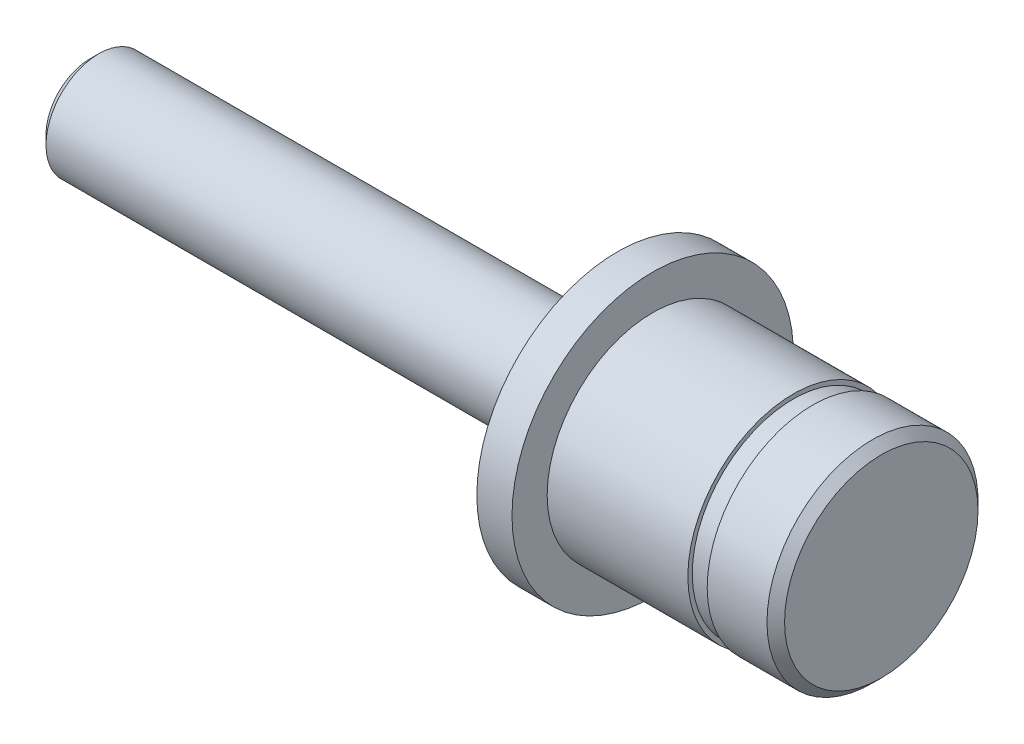
ISO-10303-21;
HEADER;
FILE_DESCRIPTION(('STEP AP214'),'2;1');
FILE_NAME('part.step','',(''),(''),'','','');
FILE_SCHEMA(('AUTOMOTIVE_DESIGN { 1 0 10303 214 1 1 1 1 }'));
ENDSEC;
DATA;
#1=APPLICATION_CONTEXT('core data for automotive mechanical design processes');
#2=APPLICATION_PROTOCOL_DEFINITION('international standard','automotive_design',2000,#1);
#3=PRODUCT_CONTEXT('',#1,'mechanical');
#4=PRODUCT('Part','Part','',(#3));
#5=PRODUCT_RELATED_PRODUCT_CATEGORY('part','',(#4));
#6=PRODUCT_DEFINITION_FORMATION('','',#4);
#7=PRODUCT_DEFINITION_CONTEXT('part definition',#1,'design');
#8=PRODUCT_DEFINITION('design','',#6,#7);
#9=PRODUCT_DEFINITION_SHAPE('','',#8);
#10=(LENGTH_UNIT() NAMED_UNIT(*) SI_UNIT(.MILLI.,.METRE.));
#11=(NAMED_UNIT(*) PLANE_ANGLE_UNIT() SI_UNIT($,.RADIAN.));
#12=(NAMED_UNIT(*) SI_UNIT($,.STERADIAN.) SOLID_ANGLE_UNIT());
#13=UNCERTAINTY_MEASURE_WITH_UNIT(LENGTH_MEASURE(1.E-05),#10,'distance_accuracy_value','');
#14=(GEOMETRIC_REPRESENTATION_CONTEXT(3) GLOBAL_UNCERTAINTY_ASSIGNED_CONTEXT((#13)) GLOBAL_UNIT_ASSIGNED_CONTEXT((#10,
#11,#12)) REPRESENTATION_CONTEXT('',''));
#15=CARTESIAN_POINT('',(0.,0.,0.));
#16=DIRECTION('',(0.,0.,1.));
#17=DIRECTION('',(1.,0.,0.));
#18=AXIS2_PLACEMENT_3D('',#15,#16,#17);
#19=CARTESIAN_POINT('',(45.,0.,0.));
#20=DIRECTION('',(-1.,0.,0.));
#21=DIRECTION('',(0.,0.,1.));
#22=AXIS2_PLACEMENT_3D('',#19,#20,#21);
#23=PLANE('',#22);
#24=CARTESIAN_POINT('',(45.,0.,0.));
#25=DIRECTION('',(-1.,0.,0.));
#26=DIRECTION('',(0.,0.,1.));
#27=AXIS2_PLACEMENT_3D('',#24,#25,#26);
#28=CIRCLE('',#27,5.50000000000005);
#29=CARTESIAN_POINT('',(45.,0.,5.50000000000005));
#30=VERTEX_POINT('',#29);
#31=EDGE_CURVE('E49',#30,#30,#28,.F.);
#32=ORIENTED_EDGE('',*,*,#31,.T.);
#33=EDGE_LOOP('',(#32));
#34=FACE_BOUND('',#33,.T.);
#35=ADVANCED_FACE('F37',(#34),#23,.F.);
#36=CARTESIAN_POINT('',(-588.066908311371,0.,0.));
#37=DIRECTION('',(-1.,0.,0.));
#38=DIRECTION('',(0.,0.,1.));
#39=AXIS2_PLACEMENT_3D('',#36,#37,#38);
#40=CYLINDRICAL_SURFACE('',#39,6.);
#41=CARTESIAN_POINT('',(44.5,0.,0.));
#42=DIRECTION('',(-1.,0.,0.));
#43=DIRECTION('',(0.,0.,1.));
#44=AXIS2_PLACEMENT_3D('',#41,#42,#43);
#45=CIRCLE('',#44,6.);
#46=CARTESIAN_POINT('',(44.5,0.,6.));
#47=VERTEX_POINT('',#46);
#48=EDGE_CURVE('E53',#47,#47,#45,.T.);
#49=ORIENTED_EDGE('',*,*,#48,.T.);
#50=EDGE_LOOP('',(#49));
#51=FACE_BOUND('',#50,.T.);
#52=CARTESIAN_POINT('',(41.1,0.,0.));
#53=DIRECTION('',(-1.,0.,0.));
#54=DIRECTION('',(0.,0.,1.));
#55=AXIS2_PLACEMENT_3D('',#52,#53,#54);
#56=CIRCLE('',#55,6.);
#57=CARTESIAN_POINT('',(41.1,0.,6.));
#58=VERTEX_POINT('',#57);
#59=EDGE_CURVE('E58',#58,#58,#56,.T.);
#60=ORIENTED_EDGE('',*,*,#59,.F.);
#61=EDGE_LOOP('',(#60));
#62=FACE_BOUND('',#61,.T.);
#63=ADVANCED_FACE('F124',(#51,#62),#40,.T.);
#64=CARTESIAN_POINT('',(41.1,6.,0.));
#65=DIRECTION('',(1.,0.,0.));
#66=DIRECTION('',(0.,0.,-1.));
#67=AXIS2_PLACEMENT_3D('',#64,#65,#66);
#68=PLANE('',#67);
#69=CARTESIAN_POINT('',(41.1,0.,0.));
#70=DIRECTION('',(-1.,0.,0.));
#71=DIRECTION('',(0.,0.,1.));
#72=AXIS2_PLACEMENT_3D('',#69,#70,#71);
#73=CIRCLE('',#72,5.75);
#74=CARTESIAN_POINT('',(41.1,0.,5.75));
#75=VERTEX_POINT('',#74);
#76=EDGE_CURVE('E61',#75,#75,#73,.T.);
#77=ORIENTED_EDGE('',*,*,#76,.F.);
#78=EDGE_LOOP('',(#77));
#79=FACE_BOUND('',#78,.T.);
#80=ORIENTED_EDGE('',*,*,#59,.T.);
#81=EDGE_LOOP('',(#80));
#82=FACE_BOUND('',#81,.T.);
#83=ADVANCED_FACE('F118',(#79,#82),#68,.F.);
#84=CARTESIAN_POINT('',(-588.066908311371,0.,0.));
#85=DIRECTION('',(-1.,0.,0.));
#86=DIRECTION('',(0.,0.,1.));
#87=AXIS2_PLACEMENT_3D('',#84,#85,#86);
#88=CYLINDRICAL_SURFACE('',#87,5.75);
#89=CARTESIAN_POINT('',(40.,0.,0.));
#90=DIRECTION('',(-1.,0.,0.));
#91=DIRECTION('',(0.,0.,1.));
#92=AXIS2_PLACEMENT_3D('',#89,#90,#91);
#93=CIRCLE('',#92,5.75);
#94=CARTESIAN_POINT('',(40.,0.,5.75));
#95=VERTEX_POINT('',#94);
#96=EDGE_CURVE('E64',#95,#95,#93,.T.);
#97=ORIENTED_EDGE('',*,*,#96,.F.);
#98=EDGE_LOOP('',(#97));
#99=FACE_BOUND('',#98,.T.);
#100=ORIENTED_EDGE('',*,*,#76,.T.);
#101=EDGE_LOOP('',(#100));
#102=FACE_BOUND('',#101,.T.);
#103=ADVANCED_FACE('F112',(#99,#102),#88,.T.);
#104=CARTESIAN_POINT('',(40.,5.75,0.));
#105=DIRECTION('',(-1.,0.,0.));
#106=DIRECTION('',(0.,0.,1.));
#107=AXIS2_PLACEMENT_3D('',#104,#105,#106);
#108=PLANE('',#107);
#109=CARTESIAN_POINT('',(40.,0.,0.));
#110=DIRECTION('',(-1.,0.,0.));
#111=DIRECTION('',(0.,0.,1.));
#112=AXIS2_PLACEMENT_3D('',#109,#110,#111);
#113=CIRCLE('',#112,6.);
#114=CARTESIAN_POINT('',(40.,0.,6.));
#115=VERTEX_POINT('',#114);
#116=EDGE_CURVE('E67',#115,#115,#113,.T.);
#117=ORIENTED_EDGE('',*,*,#116,.F.);
#118=EDGE_LOOP('',(#117));
#119=FACE_BOUND('',#118,.T.);
#120=ORIENTED_EDGE('',*,*,#96,.T.);
#121=EDGE_LOOP('',(#120));
#122=FACE_BOUND('',#121,.T.);
#123=ADVANCED_FACE('F106',(#119,#122),#108,.F.);
#124=CARTESIAN_POINT('',(-588.066908311371,0.,0.));
#125=DIRECTION('',(-1.,0.,0.));
#126=DIRECTION('',(0.,0.,1.));
#127=AXIS2_PLACEMENT_3D('',#124,#125,#126);
#128=CYLINDRICAL_SURFACE('',#127,6.);
#129=CARTESIAN_POINT('',(32.,0.,0.));
#130=DIRECTION('',(-1.,0.,0.));
#131=DIRECTION('',(0.,0.,1.));
#132=AXIS2_PLACEMENT_3D('',#129,#130,#131);
#133=CIRCLE('',#132,6.);
#134=CARTESIAN_POINT('',(32.,0.,6.));
#135=VERTEX_POINT('',#134);
#136=EDGE_CURVE('E70',#135,#135,#133,.T.);
#137=ORIENTED_EDGE('',*,*,#136,.F.);
#138=EDGE_LOOP('',(#137));
#139=FACE_BOUND('',#138,.T.);
#140=ORIENTED_EDGE('',*,*,#116,.T.);
#141=EDGE_LOOP('',(#140));
#142=FACE_BOUND('',#141,.T.);
#143=ADVANCED_FACE('F100',(#139,#142),#128,.T.);
#144=CARTESIAN_POINT('',(32.,6.,0.));
#145=DIRECTION('',(-1.,0.,0.));
#146=DIRECTION('',(0.,0.,1.));
#147=AXIS2_PLACEMENT_3D('',#144,#145,#146);
#148=PLANE('',#147);
#149=CARTESIAN_POINT('',(32.,0.,0.));
#150=DIRECTION('',(-1.,0.,0.));
#151=DIRECTION('',(0.,0.,1.));
#152=AXIS2_PLACEMENT_3D('',#149,#150,#151);
#153=CIRCLE('',#152,8.);
#154=CARTESIAN_POINT('',(32.,0.,8.));
#155=VERTEX_POINT('',#154);
#156=EDGE_CURVE('E73',#155,#155,#153,.T.);
#157=ORIENTED_EDGE('',*,*,#156,.F.);
#158=EDGE_LOOP('',(#157));
#159=FACE_BOUND('',#158,.T.);
#160=ORIENTED_EDGE('',*,*,#136,.T.);
#161=EDGE_LOOP('',(#160));
#162=FACE_BOUND('',#161,.T.);
#163=ADVANCED_FACE('F94',(#159,#162),#148,.F.);
#164=CARTESIAN_POINT('',(-588.066908311371,0.,0.));
#165=DIRECTION('',(-1.,0.,0.));
#166=DIRECTION('',(0.,0.,1.));
#167=AXIS2_PLACEMENT_3D('',#164,#165,#166);
#168=CYLINDRICAL_SURFACE('',#167,8.);
#169=CARTESIAN_POINT('',(30.,0.,0.));
#170=DIRECTION('',(-1.,0.,0.));
#171=DIRECTION('',(0.,0.,1.));
#172=AXIS2_PLACEMENT_3D('',#169,#170,#171);
#173=CIRCLE('',#172,8.);
#174=CARTESIAN_POINT('',(30.,0.,8.));
#175=VERTEX_POINT('',#174);
#176=EDGE_CURVE('E76',#175,#175,#173,.T.);
#177=ORIENTED_EDGE('',*,*,#176,.F.);
#178=EDGE_LOOP('',(#177));
#179=FACE_BOUND('',#178,.T.);
#180=ORIENTED_EDGE('',*,*,#156,.T.);
#181=EDGE_LOOP('',(#180));
#182=FACE_BOUND('',#181,.T.);
#183=ADVANCED_FACE('F88',(#179,#182),#168,.T.);
#184=CARTESIAN_POINT('',(30.,8.,0.));
#185=DIRECTION('',(1.,0.,0.));
#186=DIRECTION('',(0.,0.,-1.));
#187=AXIS2_PLACEMENT_3D('',#184,#185,#186);
#188=PLANE('',#187);
#189=CARTESIAN_POINT('',(30.,0.,0.));
#190=DIRECTION('',(-1.,0.,0.));
#191=DIRECTION('',(0.,0.,1.));
#192=AXIS2_PLACEMENT_3D('',#189,#190,#191);
#193=CIRCLE('',#192,3.);
#194=CARTESIAN_POINT('',(30.,0.,3.));
#195=VERTEX_POINT('',#194);
#196=EDGE_CURVE('E79',#195,#195,#193,.T.);
#197=ORIENTED_EDGE('',*,*,#196,.F.);
#198=EDGE_LOOP('',(#197));
#199=FACE_BOUND('',#198,.T.);
#200=ORIENTED_EDGE('',*,*,#176,.T.);
#201=EDGE_LOOP('',(#200));
#202=FACE_BOUND('',#201,.T.);
#203=ADVANCED_FACE('F85',(#199,#202),#188,.F.);
#204=CARTESIAN_POINT('',(-588.066908311371,0.,0.));
#205=DIRECTION('',(-1.,0.,0.));
#206=DIRECTION('',(0.,0.,1.));
#207=AXIS2_PLACEMENT_3D('',#204,#205,#206);
#208=CYLINDRICAL_SURFACE('',#207,3.);
#209=CARTESIAN_POINT('',(0.500000000000056,0.,0.));
#210=DIRECTION('',(1.,0.,0.));
#211=DIRECTION('',(0.,0.,-1.));
#212=AXIS2_PLACEMENT_3D('',#209,#210,#211);
#213=CIRCLE('',#212,3.);
#214=CARTESIAN_POINT('',(0.500000000000056,0.,-3.));
#215=VERTEX_POINT('',#214);
#216=EDGE_CURVE('E10',#215,#215,#213,.T.);
#217=ORIENTED_EDGE('',*,*,#216,.T.);
#218=EDGE_LOOP('',(#217));
#219=FACE_BOUND('',#218,.T.);
#220=ORIENTED_EDGE('',*,*,#196,.T.);
#221=EDGE_LOOP('',(#220));
#222=FACE_BOUND('',#221,.T.);
#223=ADVANCED_FACE('F83',(#219,#222),#208,.T.);
#224=CARTESIAN_POINT('',(0.,3.,0.));
#225=DIRECTION('',(1.,0.,0.));
#226=DIRECTION('',(0.,0.,-1.));
#227=AXIS2_PLACEMENT_3D('',#224,#225,#226);
#228=PLANE('',#227);
#229=CARTESIAN_POINT('',(0.,0.,0.));
#230=DIRECTION('',(1.,0.,0.));
#231=DIRECTION('',(0.,0.,-1.));
#232=AXIS2_PLACEMENT_3D('',#229,#230,#231);
#233=CIRCLE('',#232,2.49999999999996);
#234=CARTESIAN_POINT('',(0.,0.,-2.49999999999996));
#235=VERTEX_POINT('',#234);
#236=EDGE_CURVE('E45',#235,#235,#233,.F.);
#237=ORIENTED_EDGE('',*,*,#236,.T.);
#238=EDGE_LOOP('',(#237));
#239=FACE_BOUND('',#238,.T.);
#240=ADVANCED_FACE('F141',(#239),#228,.F.);
#241=CARTESIAN_POINT('',(44.5,0.,0.));
#242=DIRECTION('',(-1.,0.,0.));
#243=DIRECTION('',(0.,0.,1.));
#244=AXIS2_PLACEMENT_3D('',#241,#242,#243);
#245=CONICAL_SURFACE('',#244,6.,0.785398163397388);
#246=ORIENTED_EDGE('',*,*,#31,.F.);
#247=EDGE_LOOP('',(#246));
#248=FACE_BOUND('',#247,.T.);
#249=ORIENTED_EDGE('',*,*,#48,.F.);
#250=EDGE_LOOP('',(#249));
#251=FACE_BOUND('',#250,.T.);
#252=ADVANCED_FACE('F137',(#248,#251),#245,.T.);
#253=CARTESIAN_POINT('',(0.,0.,0.));
#254=DIRECTION('',(1.,0.,0.));
#255=DIRECTION('',(0.,0.,-1.));
#256=AXIS2_PLACEMENT_3D('',#253,#254,#255);
#257=CONICAL_SURFACE('',#256,2.49999999999996,0.785398163397432);
#258=ORIENTED_EDGE('',*,*,#216,.F.);
#259=EDGE_LOOP('',(#258));
#260=FACE_BOUND('',#259,.T.);
#261=ORIENTED_EDGE('',*,*,#236,.F.);
#262=EDGE_LOOP('',(#261));
#263=FACE_BOUND('',#262,.T.);
#264=ADVANCED_FACE('F40',(#260,#263),#257,.T.);
#265=CLOSED_SHELL('',(#35,#63,#83,#103,#123,#143,#163,#183,#203,#223,#240,#252,#264));
#266=MANIFOLD_SOLID_BREP('B2',#265);
#267=ADVANCED_BREP_SHAPE_REPRESENTATION('',(#18,#266),#14);
#268=SHAPE_DEFINITION_REPRESENTATION(#9,#267);
ENDSEC;
END-ISO-10303-21;
